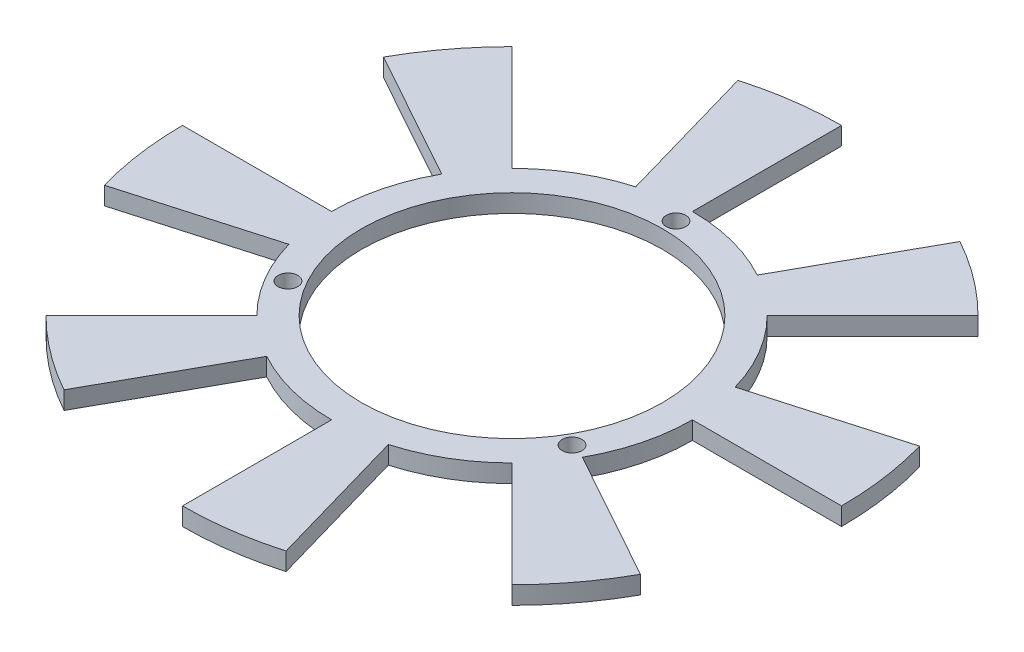
ISO-10303-21;
HEADER;
FILE_DESCRIPTION(('STEP AP214'),'2;1');
FILE_NAME('part.step','',(''),(''),'','','');
FILE_SCHEMA(('AUTOMOTIVE_DESIGN { 1 0 10303 214 1 1 1 1 }'));
ENDSEC;
DATA;
#1=APPLICATION_CONTEXT('core data for automotive mechanical design processes');
#2=APPLICATION_PROTOCOL_DEFINITION('international standard','automotive_design',2000,#1);
#3=PRODUCT_CONTEXT('',#1,'mechanical');
#4=PRODUCT('Part','Part','',(#3));
#5=PRODUCT_RELATED_PRODUCT_CATEGORY('part','',(#4));
#6=PRODUCT_DEFINITION_FORMATION('','',#4);
#7=PRODUCT_DEFINITION_CONTEXT('part definition',#1,'design');
#8=PRODUCT_DEFINITION('design','',#6,#7);
#9=PRODUCT_DEFINITION_SHAPE('','',#8);
#10=(LENGTH_UNIT() NAMED_UNIT(*) SI_UNIT(.MILLI.,.METRE.));
#11=(NAMED_UNIT(*) PLANE_ANGLE_UNIT() SI_UNIT($,.RADIAN.));
#12=(NAMED_UNIT(*) SI_UNIT($,.STERADIAN.) SOLID_ANGLE_UNIT());
#13=UNCERTAINTY_MEASURE_WITH_UNIT(LENGTH_MEASURE(1.E-05),#10,'distance_accuracy_value','');
#14=(GEOMETRIC_REPRESENTATION_CONTEXT(3) GLOBAL_UNCERTAINTY_ASSIGNED_CONTEXT((#13)) GLOBAL_UNIT_ASSIGNED_CONTEXT((#10,
#11,#12)) REPRESENTATION_CONTEXT('',''));
#15=CARTESIAN_POINT('',(0.,0.,0.));
#16=DIRECTION('',(0.,0.,1.));
#17=DIRECTION('',(1.,0.,0.));
#18=AXIS2_PLACEMENT_3D('',#15,#16,#17);
#19=CARTESIAN_POINT('',(0.,-3.,0.));
#20=DIRECTION('',(0.,1.,0.));
#21=DIRECTION('',(0.,0.,1.));
#22=AXIS2_PLACEMENT_3D('',#19,#20,#21);
#23=CYLINDRICAL_SURFACE('',#22,30.25);
#24=DIRECTION('',(0.,-1.,0.));
#25=VECTOR('',#24,1.);
#26=CARTESIAN_POINT('',(-14.6654910124514,0.,26.4572461409669));
#27=LINE('',#26,#25);
#28=CARTESIAN_POINT('',(-14.6654910124514,0.,26.4572461409669));
#29=VERTEX_POINT('',#28);
#30=CARTESIAN_POINT('',(-14.6654910124514,-3.,26.4572461409669));
#31=VERTEX_POINT('',#30);
#32=EDGE_CURVE('E286',#29,#31,#27,.T.);
#33=ORIENTED_EDGE('',*,*,#32,.T.);
#34=CARTESIAN_POINT('',(0.,-3.,0.));
#35=DIRECTION('',(0.,1.,0.));
#36=DIRECTION('',(1.,0.,0.));
#37=AXIS2_PLACEMENT_3D('',#34,#35,#36);
#38=CIRCLE('',#37,30.25);
#39=CARTESIAN_POINT('',(0.,-3.,30.25));
#40=VERTEX_POINT('',#39);
#41=EDGE_CURVE('E51',#31,#40,#38,.T.);
#42=ORIENTED_EDGE('',*,*,#41,.T.);
#43=DIRECTION('',(0.,-1.,0.));
#44=VECTOR('',#43,1.);
#45=CARTESIAN_POINT('',(0.,0.,30.25));
#46=LINE('',#45,#44);
#47=CARTESIAN_POINT('',(0.,0.,30.25));
#48=VERTEX_POINT('',#47);
#49=EDGE_CURVE('E442',#48,#40,#46,.T.);
#50=ORIENTED_EDGE('',*,*,#49,.F.);
#51=CARTESIAN_POINT('',(0.,0.,0.));
#52=DIRECTION('',(0.,1.,0.));
#53=DIRECTION('',(1.,0.,0.));
#54=AXIS2_PLACEMENT_3D('',#51,#52,#53);
#55=CIRCLE('',#54,30.25);
#56=EDGE_CURVE('E541',#29,#48,#55,.T.);
#57=ORIENTED_EDGE('',*,*,#56,.F.);
#58=EDGE_LOOP('',(#33,#42,#50,#57));
#59=FACE_BOUND('',#58,.T.);
#60=ADVANCED_FACE('F41',(#59),#23,.T.);
#61=DIRECTION('',(0.,-1.,0.));
#62=VECTOR('',#61,1.);
#63=CARTESIAN_POINT('',(-21.389980130893,0.,21.3899801308931));
#64=LINE('',#63,#62);
#65=CARTESIAN_POINT('',(-21.389980130893,0.,21.3899801308931));
#66=VERTEX_POINT('',#65);
#67=CARTESIAN_POINT('',(-21.389980130893,-3.,21.3899801308931));
#68=VERTEX_POINT('',#67);
#69=EDGE_CURVE('E265',#66,#68,#64,.T.);
#70=ORIENTED_EDGE('',*,*,#69,.F.);
#71=CARTESIAN_POINT('',(-29.0781663021341,0.,8.33803001346455));
#72=VERTEX_POINT('',#71);
#73=EDGE_CURVE('E271',#72,#66,#55,.T.);
#74=ORIENTED_EDGE('',*,*,#73,.F.);
#75=DIRECTION('',(0.,-1.,0.));
#76=VECTOR('',#75,1.);
#77=CARTESIAN_POINT('',(-29.0781663021341,0.,8.33803001346455));
#78=LINE('',#77,#76);
#79=CARTESIAN_POINT('',(-29.0781663021341,-3.,8.33803001346455));
#80=VERTEX_POINT('',#79);
#81=EDGE_CURVE('E308',#72,#80,#78,.T.);
#82=ORIENTED_EDGE('',*,*,#81,.T.);
#83=EDGE_CURVE('E612',#80,#68,#38,.T.);
#84=ORIENTED_EDGE('',*,*,#83,.T.);
#85=EDGE_LOOP('',(#70,#74,#82,#84));
#86=FACE_BOUND('',#85,.T.);
#87=ADVANCED_FACE('F516',(#86),#23,.T.);
#88=DIRECTION('',(0.,-1.,0.));
#89=VECTOR('',#88,1.);
#90=CARTESIAN_POINT('',(-30.25,0.,0.));
#91=LINE('',#90,#89);
#92=CARTESIAN_POINT('',(-30.25,0.,0.));
#93=VERTEX_POINT('',#92);
#94=CARTESIAN_POINT('',(-30.25,-3.,0.));
#95=VERTEX_POINT('',#94);
#96=EDGE_CURVE('E311',#93,#95,#91,.T.);
#97=ORIENTED_EDGE('',*,*,#96,.F.);
#98=CARTESIAN_POINT('',(-26.4572461409669,0.,-14.6654910124514));
#99=VERTEX_POINT('',#98);
#100=EDGE_CURVE('E589',#99,#93,#55,.T.);
#101=ORIENTED_EDGE('',*,*,#100,.F.);
#102=DIRECTION('',(0.,-1.,0.));
#103=VECTOR('',#102,1.);
#104=CARTESIAN_POINT('',(-26.4572461409669,0.,-14.6654910124514));
#105=LINE('',#104,#103);
#106=CARTESIAN_POINT('',(-26.4572461409669,-3.,-14.6654910124514));
#107=VERTEX_POINT('',#106);
#108=EDGE_CURVE('E334',#99,#107,#105,.T.);
#109=ORIENTED_EDGE('',*,*,#108,.T.);
#110=EDGE_CURVE('E601',#107,#95,#38,.T.);
#111=ORIENTED_EDGE('',*,*,#110,.T.);
#112=EDGE_LOOP('',(#97,#101,#109,#111));
#113=FACE_BOUND('',#112,.T.);
#114=ADVANCED_FACE('F521',(#113),#23,.T.);
#115=DIRECTION('',(0.,-1.,0.));
#116=VECTOR('',#115,1.);
#117=CARTESIAN_POINT('',(-21.3899801308931,0.,-21.389980130893));
#118=LINE('',#117,#116);
#119=CARTESIAN_POINT('',(-21.3899801308931,0.,-21.389980130893));
#120=VERTEX_POINT('',#119);
#121=CARTESIAN_POINT('',(-21.3899801308931,-3.,-21.389980130893));
#122=VERTEX_POINT('',#121);
#123=EDGE_CURVE('E337',#120,#122,#118,.T.);
#124=ORIENTED_EDGE('',*,*,#123,.F.);
#125=CARTESIAN_POINT('',(-8.33803001346424,0.,-29.0781663021341));
#126=VERTEX_POINT('',#125);
#127=EDGE_CURVE('E587',#126,#120,#55,.T.);
#128=ORIENTED_EDGE('',*,*,#127,.F.);
#129=DIRECTION('',(0.,-1.,0.));
#130=VECTOR('',#129,1.);
#131=CARTESIAN_POINT('',(-8.33803001346424,0.,-29.0781663021341));
#132=LINE('',#131,#130);
#133=CARTESIAN_POINT('',(-8.33803001346424,-3.,-29.0781663021341));
#134=VERTEX_POINT('',#133);
#135=EDGE_CURVE('E360',#126,#134,#132,.T.);
#136=ORIENTED_EDGE('',*,*,#135,.T.);
#137=EDGE_CURVE('E865',#134,#122,#38,.T.);
#138=ORIENTED_EDGE('',*,*,#137,.T.);
#139=EDGE_LOOP('',(#124,#128,#136,#138));
#140=FACE_BOUND('',#139,.T.);
#141=ADVANCED_FACE('F864',(#140),#23,.T.);
#142=DIRECTION('',(0.,-1.,0.));
#143=VECTOR('',#142,1.);
#144=CARTESIAN_POINT('',(0.,0.,-30.25));
#145=LINE('',#144,#143);
#146=CARTESIAN_POINT('',(0.,0.,-30.25));
#147=VERTEX_POINT('',#146);
#148=CARTESIAN_POINT('',(0.,-3.,-30.25));
#149=VERTEX_POINT('',#148);
#150=EDGE_CURVE('E363',#147,#149,#145,.T.);
#151=ORIENTED_EDGE('',*,*,#150,.F.);
#152=CARTESIAN_POINT('',(14.6654910124512,0.,-26.457246140967));
#153=VERTEX_POINT('',#152);
#154=EDGE_CURVE('E543',#153,#147,#55,.T.);
#155=ORIENTED_EDGE('',*,*,#154,.F.);
#156=DIRECTION('',(0.,-1.,0.));
#157=VECTOR('',#156,1.);
#158=CARTESIAN_POINT('',(14.6654910124512,0.,-26.457246140967));
#159=LINE('',#158,#157);
#160=CARTESIAN_POINT('',(14.6654910124512,-3.,-26.457246140967));
#161=VERTEX_POINT('',#160);
#162=EDGE_CURVE('E386',#153,#161,#159,.T.);
#163=ORIENTED_EDGE('',*,*,#162,.T.);
#164=EDGE_CURVE('E867',#161,#149,#38,.T.);
#165=ORIENTED_EDGE('',*,*,#164,.T.);
#166=EDGE_LOOP('',(#151,#155,#163,#165));
#167=FACE_BOUND('',#166,.T.);
#168=ADVANCED_FACE('F872',(#167),#23,.T.);
#169=DIRECTION('',(0.,-1.,0.));
#170=VECTOR('',#169,1.);
#171=CARTESIAN_POINT('',(21.3899801308931,0.,-21.3899801308931));
#172=LINE('',#171,#170);
#173=CARTESIAN_POINT('',(21.3899801308931,0.,-21.3899801308931));
#174=VERTEX_POINT('',#173);
#175=CARTESIAN_POINT('',(21.3899801308931,-3.,-21.3899801308931));
#176=VERTEX_POINT('',#175);
#177=EDGE_CURVE('E389',#174,#176,#172,.T.);
#178=ORIENTED_EDGE('',*,*,#177,.F.);
#179=CARTESIAN_POINT('',(29.078166302134,0.,-8.33803001346475));
#180=VERTEX_POINT('',#179);
#181=EDGE_CURVE('E540',#180,#174,#55,.T.);
#182=ORIENTED_EDGE('',*,*,#181,.F.);
#183=DIRECTION('',(0.,-1.,0.));
#184=VECTOR('',#183,1.);
#185=CARTESIAN_POINT('',(29.078166302134,0.,-8.33803001346475));
#186=LINE('',#185,#184);
#187=CARTESIAN_POINT('',(29.078166302134,-3.,-8.33803001346475));
#188=VERTEX_POINT('',#187);
#189=EDGE_CURVE('E412',#180,#188,#186,.T.);
#190=ORIENTED_EDGE('',*,*,#189,.T.);
#191=EDGE_CURVE('E50',#188,#176,#38,.T.);
#192=ORIENTED_EDGE('',*,*,#191,.T.);
#193=EDGE_LOOP('',(#178,#182,#190,#192));
#194=FACE_BOUND('',#193,.T.);
#195=ADVANCED_FACE('F529',(#194),#23,.T.);
#196=DIRECTION('',(0.,-1.,0.));
#197=VECTOR('',#196,1.);
#198=CARTESIAN_POINT('',(8.33803001346424,0.,29.0781663021341));
#199=LINE('',#198,#197);
#200=CARTESIAN_POINT('',(8.33803001346424,0.,29.0781663021341));
#201=VERTEX_POINT('',#200);
#202=CARTESIAN_POINT('',(8.33803001346424,-3.,29.0781663021341));
#203=VERTEX_POINT('',#202);
#204=EDGE_CURVE('E439',#201,#203,#199,.T.);
#205=ORIENTED_EDGE('',*,*,#204,.T.);
#206=CARTESIAN_POINT('',(21.3899801308931,-3.,21.3899801308931));
#207=VERTEX_POINT('',#206);
#208=EDGE_CURVE('E52',#203,#207,#38,.T.);
#209=ORIENTED_EDGE('',*,*,#208,.T.);
#210=DIRECTION('',(0.,-1.,0.));
#211=VECTOR('',#210,1.);
#212=CARTESIAN_POINT('',(21.3899801308931,0.,21.3899801308931));
#213=LINE('',#212,#211);
#214=CARTESIAN_POINT('',(21.3899801308931,0.,21.3899801308931));
#215=VERTEX_POINT('',#214);
#216=EDGE_CURVE('E470',#215,#207,#213,.T.);
#217=ORIENTED_EDGE('',*,*,#216,.F.);
#218=EDGE_CURVE('E495',#201,#215,#55,.T.);
#219=ORIENTED_EDGE('',*,*,#218,.F.);
#220=EDGE_LOOP('',(#205,#209,#217,#219));
#221=FACE_BOUND('',#220,.T.);
#222=ADVANCED_FACE('F524',(#221),#23,.T.);
#223=DIRECTION('',(0.,-1.,0.));
#224=VECTOR('',#223,1.);
#225=CARTESIAN_POINT('',(30.25,0.,0.));
#226=LINE('',#225,#224);
#227=CARTESIAN_POINT('',(30.25,0.,0.));
#228=VERTEX_POINT('',#227);
#229=CARTESIAN_POINT('',(30.25,-3.,0.));
#230=VERTEX_POINT('',#229);
#231=EDGE_CURVE('E415',#228,#230,#226,.T.);
#232=ORIENTED_EDGE('',*,*,#231,.F.);
#233=CARTESIAN_POINT('',(26.457246140967,0.,14.6654910124513));
#234=VERTEX_POINT('',#233);
#235=EDGE_CURVE('E45',#234,#228,#55,.T.);
#236=ORIENTED_EDGE('',*,*,#235,.F.);
#237=DIRECTION('',(0.,-1.,0.));
#238=VECTOR('',#237,1.);
#239=CARTESIAN_POINT('',(26.457246140967,0.,14.6654910124513));
#240=LINE('',#239,#238);
#241=CARTESIAN_POINT('',(26.457246140967,-3.,14.6654910124513));
#242=VERTEX_POINT('',#241);
#243=EDGE_CURVE('E467',#234,#242,#240,.T.);
#244=ORIENTED_EDGE('',*,*,#243,.T.);
#245=EDGE_CURVE('E12',#242,#230,#38,.T.);
#246=ORIENTED_EDGE('',*,*,#245,.T.);
#247=EDGE_LOOP('',(#232,#236,#244,#246));
#248=FACE_BOUND('',#247,.T.);
#249=ADVANCED_FACE('F43',(#248),#23,.T.);
#250=CARTESIAN_POINT('',(0.,-3.,0.));
#251=DIRECTION('',(0.,1.,0.));
#252=DIRECTION('',(0.,0.,1.));
#253=AXIS2_PLACEMENT_3D('',#250,#251,#252);
#254=PLANE('',#253);
#255=CARTESIAN_POINT('',(0.,-3.,-27.5));
#256=DIRECTION('',(0.,1.,0.));
#257=DIRECTION('',(0.,0.,1.));
#258=AXIS2_PLACEMENT_3D('',#255,#256,#257);
#259=CIRCLE('',#258,1.65);
#260=CARTESIAN_POINT('',(0.,-3.,-25.85));
#261=VERTEX_POINT('',#260);
#262=EDGE_CURVE('E488',#261,#261,#259,.T.);
#263=ORIENTED_EDGE('',*,*,#262,.T.);
#264=EDGE_LOOP('',(#263));
#265=FACE_BOUND('',#264,.T.);
#266=CARTESIAN_POINT('',(23.815698604072,-3.,13.7500000000001));
#267=DIRECTION('',(0.,1.,0.));
#268=DIRECTION('',(0.,0.,1.));
#269=AXIS2_PLACEMENT_3D('',#266,#267,#268);
#270=CIRCLE('',#269,1.65);
#271=CARTESIAN_POINT('',(23.815698604072,-3.,15.4000000000001));
#272=VERTEX_POINT('',#271);
#273=EDGE_CURVE('E485',#272,#272,#270,.T.);
#274=ORIENTED_EDGE('',*,*,#273,.T.);
#275=EDGE_LOOP('',(#274));
#276=FACE_BOUND('',#275,.T.);
#277=CARTESIAN_POINT('',(-23.815698604072,-3.,13.7500000000001));
#278=DIRECTION('',(0.,1.,0.));
#279=DIRECTION('',(0.,0.,1.));
#280=AXIS2_PLACEMENT_3D('',#277,#278,#279);
#281=CIRCLE('',#280,1.65);
#282=CARTESIAN_POINT('',(-23.815698604072,-3.,15.4000000000001));
#283=VERTEX_POINT('',#282);
#284=EDGE_CURVE('E477',#283,#283,#281,.T.);
#285=ORIENTED_EDGE('',*,*,#284,.T.);
#286=EDGE_LOOP('',(#285));
#287=FACE_BOUND('',#286,.T.);
#288=CARTESIAN_POINT('',(0.,-3.,0.));
#289=DIRECTION('',(0.,1.,0.));
#290=DIRECTION('',(0.,0.,1.));
#291=AXIS2_PLACEMENT_3D('',#288,#289,#290);
#292=CIRCLE('',#291,25.25);
#293=CARTESIAN_POINT('',(0.,-3.,25.25));
#294=VERTEX_POINT('',#293);
#295=EDGE_CURVE('E492',#294,#294,#292,.T.);
#296=ORIENTED_EDGE('',*,*,#295,.T.);
#297=EDGE_LOOP('',(#296));
#298=FACE_BOUND('',#297,.T.);
#299=ORIENTED_EDGE('',*,*,#245,.F.);
#300=DIRECTION('',(0.874619707139387,0.,0.484809620246354));
#301=VECTOR('',#300,1.);
#302=CARTESIAN_POINT('',(26.457246140967,-3.,14.6654910124513));
#303=LINE('',#302,#301);
#304=CARTESIAN_POINT('',(48.3227388194516,-3.,26.7857315186101));
#305=VERTEX_POINT('',#304);
#306=EDGE_CURVE('E450',#242,#305,#303,.T.);
#307=ORIENTED_EDGE('',*,*,#306,.T.);
#308=CARTESIAN_POINT('',(0.,-3.,0.));
#309=DIRECTION('',(0.,-1.,0.));
#310=DIRECTION('',(0.,0.,-1.));
#311=AXIS2_PLACEMENT_3D('',#308,#309,#310);
#312=CIRCLE('',#311,55.25);
#313=CARTESIAN_POINT('',(39.0676496605568,-3.,39.0676496605568));
#314=VERTEX_POINT('',#313);
#315=EDGE_CURVE('E438',#305,#314,#312,.T.);
#316=ORIENTED_EDGE('',*,*,#315,.T.);
#317=DIRECTION('',(-0.707106781186547,0.,-0.707106781186548));
#318=VECTOR('',#317,1.);
#319=CARTESIAN_POINT('',(39.0676496605568,-3.,39.0676496605568));
#320=LINE('',#319,#318);
#321=EDGE_CURVE('E459',#314,#207,#320,.T.);
#322=ORIENTED_EDGE('',*,*,#321,.T.);
#323=ORIENTED_EDGE('',*,*,#208,.F.);
#324=DIRECTION('',(0.275637355817,0.,0.961261695938319));
#325=VECTOR('',#324,1.);
#326=CARTESIAN_POINT('',(8.33803001346424,-3.,29.0781663021341));
#327=LINE('',#326,#325);
#328=CARTESIAN_POINT('',(15.2289639088892,-3.,53.1097087005921));
#329=VERTEX_POINT('',#328);
#330=EDGE_CURVE('E422',#203,#329,#327,.T.);
#331=ORIENTED_EDGE('',*,*,#330,.T.);
#332=CARTESIAN_POINT('',(0.,-3.,0.));
#333=DIRECTION('',(0.,-1.,0.));
#334=DIRECTION('',(0.,0.,-1.));
#335=AXIS2_PLACEMENT_3D('',#332,#333,#334);
#336=CIRCLE('',#335,55.25);
#337=CARTESIAN_POINT('',(0.,-3.,55.25));
#338=VERTEX_POINT('',#337);
#339=EDGE_CURVE('E411',#329,#338,#336,.T.);
#340=ORIENTED_EDGE('',*,*,#339,.T.);
#341=DIRECTION('',(0.,0.,-1.));
#342=VECTOR('',#341,1.);
#343=CARTESIAN_POINT('',(0.,-3.,55.25));
#344=LINE('',#343,#342);
#345=EDGE_CURVE('E431',#338,#40,#344,.T.);
#346=ORIENTED_EDGE('',*,*,#345,.T.);
#347=ORIENTED_EDGE('',*,*,#41,.F.);
#348=DIRECTION('',(-0.48480962024635,0.,0.874619707139389));
#349=VECTOR('',#348,1.);
#350=CARTESIAN_POINT('',(-14.6654910124514,-3.,26.4572461409669));
#351=LINE('',#350,#349);
#352=CARTESIAN_POINT('',(-26.7857315186101,-3.,48.3227388194516));
#353=VERTEX_POINT('',#352);
#354=EDGE_CURVE('E275',#31,#353,#351,.T.);
#355=ORIENTED_EDGE('',*,*,#354,.T.);
#356=CARTESIAN_POINT('',(0.,-3.,0.));
#357=DIRECTION('',(0.,-1.,0.));
#358=DIRECTION('',(0.,0.,-1.));
#359=AXIS2_PLACEMENT_3D('',#356,#357,#358);
#360=CIRCLE('',#359,55.25);
#361=CARTESIAN_POINT('',(-39.0676496605568,-3.,39.0676496605568));
#362=VERTEX_POINT('',#361);
#363=EDGE_CURVE('E281',#353,#362,#360,.T.);
#364=ORIENTED_EDGE('',*,*,#363,.T.);
#365=DIRECTION('',(0.707106781186549,0.,-0.707106781186546));
#366=VECTOR('',#365,1.);
#367=CARTESIAN_POINT('',(-39.0676496605568,-3.,39.0676496605568));
#368=LINE('',#367,#366);
#369=EDGE_CURVE('E260',#362,#68,#368,.T.);
#370=ORIENTED_EDGE('',*,*,#369,.T.);
#371=ORIENTED_EDGE('',*,*,#83,.F.);
#372=DIRECTION('',(-0.961261695938322,0.,0.275637355816987));
#373=VECTOR('',#372,1.);
#374=CARTESIAN_POINT('',(-29.0781663021341,-3.,8.33803001346455));
#375=LINE('',#374,#373);
#376=CARTESIAN_POINT('',(-53.1097087005921,-3.,15.2289639088892));
#377=VERTEX_POINT('',#376);
#378=EDGE_CURVE('E294',#80,#377,#375,.T.);
#379=ORIENTED_EDGE('',*,*,#378,.T.);
#380=CARTESIAN_POINT('',(0.,-3.,0.));
#381=DIRECTION('',(0.,-1.,0.));
#382=DIRECTION('',(0.,0.,-1.));
#383=AXIS2_PLACEMENT_3D('',#380,#381,#382);
#384=CIRCLE('',#383,55.25);
#385=CARTESIAN_POINT('',(-55.25,-3.,0.));
#386=VERTEX_POINT('',#385);
#387=EDGE_CURVE('E285',#377,#386,#384,.T.);
#388=ORIENTED_EDGE('',*,*,#387,.T.);
#389=DIRECTION('',(1.,0.,0.));
#390=VECTOR('',#389,1.);
#391=CARTESIAN_POINT('',(-55.25,-3.,0.));
#392=LINE('',#391,#390);
#393=EDGE_CURVE('E300',#386,#95,#392,.T.);
#394=ORIENTED_EDGE('',*,*,#393,.T.);
#395=ORIENTED_EDGE('',*,*,#110,.F.);
#396=DIRECTION('',(-0.874619707139391,0.,-0.484809620246346));
#397=VECTOR('',#396,1.);
#398=CARTESIAN_POINT('',(-26.4572461409669,-3.,-14.6654910124515));
#399=LINE('',#398,#397);
#400=CARTESIAN_POINT('',(-48.3227388194516,-3.,-26.7857315186101));
#401=VERTEX_POINT('',#400);
#402=EDGE_CURVE('E318',#107,#401,#399,.T.);
#403=ORIENTED_EDGE('',*,*,#402,.T.);
#404=CARTESIAN_POINT('',(0.,-3.,0.));
#405=DIRECTION('',(0.,-1.,0.));
#406=DIRECTION('',(0.,0.,-1.));
#407=AXIS2_PLACEMENT_3D('',#404,#405,#406);
#408=CIRCLE('',#407,55.25);
#409=CARTESIAN_POINT('',(-39.0676496605568,-3.,-39.0676496605568));
#410=VERTEX_POINT('',#409);
#411=EDGE_CURVE('E307',#401,#410,#408,.T.);
#412=ORIENTED_EDGE('',*,*,#411,.T.);
#413=DIRECTION('',(0.707106781186547,0.,0.707106781186548));
#414=VECTOR('',#413,1.);
#415=CARTESIAN_POINT('',(-39.0676496605568,-3.,-39.0676496605568));
#416=LINE('',#415,#414);
#417=EDGE_CURVE('E326',#410,#122,#416,.T.);
#418=ORIENTED_EDGE('',*,*,#417,.T.);
#419=ORIENTED_EDGE('',*,*,#137,.F.);
#420=DIRECTION('',(-0.275637355817,0.,-0.961261695938319));
#421=VECTOR('',#420,1.);
#422=CARTESIAN_POINT('',(-8.33803001346424,-3.,-29.0781663021341));
#423=LINE('',#422,#421);
#424=CARTESIAN_POINT('',(-15.2289639088892,-3.,-53.1097087005921));
#425=VERTEX_POINT('',#424);
#426=EDGE_CURVE('E344',#134,#425,#423,.T.);
#427=ORIENTED_EDGE('',*,*,#426,.T.);
#428=CARTESIAN_POINT('',(0.,-3.,0.));
#429=DIRECTION('',(0.,-1.,0.));
#430=DIRECTION('',(0.,0.,-1.));
#431=AXIS2_PLACEMENT_3D('',#428,#429,#430);
#432=CIRCLE('',#431,55.25);
#433=CARTESIAN_POINT('',(0.,-3.,-55.25));
#434=VERTEX_POINT('',#433);
#435=EDGE_CURVE('E333',#425,#434,#432,.T.);
#436=ORIENTED_EDGE('',*,*,#435,.T.);
#437=DIRECTION('',(0.,0.,1.));
#438=VECTOR('',#437,1.);
#439=CARTESIAN_POINT('',(0.,-3.,-55.25));
#440=LINE('',#439,#438);
#441=EDGE_CURVE('E352',#434,#149,#440,.T.);
#442=ORIENTED_EDGE('',*,*,#441,.T.);
#443=ORIENTED_EDGE('',*,*,#164,.F.);
#444=DIRECTION('',(0.484809620246357,0.,-0.874619707139385));
#445=VECTOR('',#444,1.);
#446=CARTESIAN_POINT('',(14.6654910124512,-3.,-26.457246140967));
#447=LINE('',#446,#445);
#448=CARTESIAN_POINT('',(26.7857315186101,-3.,-48.3227388194516));
#449=VERTEX_POINT('',#448);
#450=EDGE_CURVE('E370',#161,#449,#447,.T.);
#451=ORIENTED_EDGE('',*,*,#450,.T.);
#452=CARTESIAN_POINT('',(0.,-3.,0.));
#453=DIRECTION('',(0.,-1.,0.));
#454=DIRECTION('',(0.,0.,-1.));
#455=AXIS2_PLACEMENT_3D('',#452,#453,#454);
#456=CIRCLE('',#455,55.25);
#457=CARTESIAN_POINT('',(39.0676496605568,-3.,-39.0676496605568));
#458=VERTEX_POINT('',#457);
#459=EDGE_CURVE('E359',#449,#458,#456,.T.);
#460=ORIENTED_EDGE('',*,*,#459,.T.);
#461=DIRECTION('',(-0.707106781186548,0.,0.707106781186547));
#462=VECTOR('',#461,1.);
#463=CARTESIAN_POINT('',(39.0676496605568,-3.,-39.0676496605568));
#464=LINE('',#463,#462);
#465=EDGE_CURVE('E378',#458,#176,#464,.T.);
#466=ORIENTED_EDGE('',*,*,#465,.T.);
#467=ORIENTED_EDGE('',*,*,#191,.F.);
#468=DIRECTION('',(0.961261695938325,0.,-0.27563735581698));
#469=VECTOR('',#468,1.);
#470=CARTESIAN_POINT('',(29.078166302134,-3.,-8.33803001346475));
#471=LINE('',#470,#469);
#472=CARTESIAN_POINT('',(53.1097087005921,-3.,-15.2289639088892));
#473=VERTEX_POINT('',#472);
#474=EDGE_CURVE('E396',#188,#473,#471,.T.);
#475=ORIENTED_EDGE('',*,*,#474,.T.);
#476=CARTESIAN_POINT('',(0.,-3.,0.));
#477=DIRECTION('',(0.,-1.,0.));
#478=DIRECTION('',(0.,0.,-1.));
#479=AXIS2_PLACEMENT_3D('',#476,#477,#478);
#480=CIRCLE('',#479,55.25);
#481=CARTESIAN_POINT('',(55.25,-3.,0.));
#482=VERTEX_POINT('',#481);
#483=EDGE_CURVE('E385',#473,#482,#480,.T.);
#484=ORIENTED_EDGE('',*,*,#483,.T.);
#485=DIRECTION('',(-1.,0.,0.));
#486=VECTOR('',#485,1.);
#487=CARTESIAN_POINT('',(55.25,-3.,0.));
#488=LINE('',#487,#486);
#489=EDGE_CURVE('E404',#482,#230,#488,.T.);
#490=ORIENTED_EDGE('',*,*,#489,.T.);
#491=EDGE_LOOP('',(#299,#307,#316,#322,#323,#331,#340,#346,#347,#355,#364,#370,#371,#379,#388,
#394,#395,#403,#412,#418,#419,#427,#436,#442,#443,#451,#460,#466,#467,#475,#484,#490));
#492=FACE_BOUND('',#491,.T.);
#493=ADVANCED_FACE('F502',(#265,#276,#287,#298,#492),#254,.F.);
#494=CARTESIAN_POINT('',(0.,0.,0.));
#495=DIRECTION('',(0.,1.,0.));
#496=DIRECTION('',(0.,0.,1.));
#497=AXIS2_PLACEMENT_3D('',#494,#495,#496);
#498=PLANE('',#497);
#499=CARTESIAN_POINT('',(0.,0.,-27.5));
#500=DIRECTION('',(0.,1.,0.));
#501=DIRECTION('',(0.,0.,1.));
#502=AXIS2_PLACEMENT_3D('',#499,#500,#501);
#503=CIRCLE('',#502,1.65);
#504=CARTESIAN_POINT('',(0.,0.,-25.85));
#505=VERTEX_POINT('',#504);
#506=EDGE_CURVE('E474',#505,#505,#503,.T.);
#507=ORIENTED_EDGE('',*,*,#506,.F.);
#508=EDGE_LOOP('',(#507));
#509=FACE_BOUND('',#508,.T.);
#510=CARTESIAN_POINT('',(23.815698604072,0.,13.7500000000001));
#511=DIRECTION('',(0.,1.,0.));
#512=DIRECTION('',(0.,0.,1.));
#513=AXIS2_PLACEMENT_3D('',#510,#511,#512);
#514=CIRCLE('',#513,1.65);
#515=CARTESIAN_POINT('',(23.815698604072,0.,15.4000000000001));
#516=VERTEX_POINT('',#515);
#517=EDGE_CURVE('E478',#516,#516,#514,.T.);
#518=ORIENTED_EDGE('',*,*,#517,.F.);
#519=EDGE_LOOP('',(#518));
#520=FACE_BOUND('',#519,.T.);
#521=CARTESIAN_POINT('',(-23.815698604072,0.,13.7500000000001));
#522=DIRECTION('',(0.,1.,0.));
#523=DIRECTION('',(0.,0.,1.));
#524=AXIS2_PLACEMENT_3D('',#521,#522,#523);
#525=CIRCLE('',#524,1.65);
#526=CARTESIAN_POINT('',(-23.815698604072,0.,15.4000000000001));
#527=VERTEX_POINT('',#526);
#528=EDGE_CURVE('E466',#527,#527,#525,.T.);
#529=ORIENTED_EDGE('',*,*,#528,.F.);
#530=EDGE_LOOP('',(#529));
#531=FACE_BOUND('',#530,.T.);
#532=CARTESIAN_POINT('',(0.,0.,0.));
#533=DIRECTION('',(0.,1.,0.));
#534=DIRECTION('',(0.,0.,1.));
#535=AXIS2_PLACEMENT_3D('',#532,#533,#534);
#536=CIRCLE('',#535,25.25);
#537=CARTESIAN_POINT('',(0.,0.,25.25));
#538=VERTEX_POINT('',#537);
#539=EDGE_CURVE('E491',#538,#538,#536,.T.);
#540=ORIENTED_EDGE('',*,*,#539,.F.);
#541=EDGE_LOOP('',(#540));
#542=FACE_BOUND('',#541,.T.);
#543=ORIENTED_EDGE('',*,*,#235,.T.);
#544=DIRECTION('',(-1.,0.,0.));
#545=VECTOR('',#544,1.);
#546=CARTESIAN_POINT('',(55.25,0.,0.));
#547=LINE('',#546,#545);
#548=CARTESIAN_POINT('',(55.25,0.,0.));
#549=VERTEX_POINT('',#548);
#550=EDGE_CURVE('E395',#549,#228,#547,.T.);
#551=ORIENTED_EDGE('',*,*,#550,.F.);
#552=CARTESIAN_POINT('',(0.,0.,0.));
#553=DIRECTION('',(0.,-1.,0.));
#554=DIRECTION('',(0.,0.,-1.));
#555=AXIS2_PLACEMENT_3D('',#552,#553,#554);
#556=CIRCLE('',#555,55.25);
#557=CARTESIAN_POINT('',(53.1097087005921,0.,-15.2289639088892));
#558=VERTEX_POINT('',#557);
#559=EDGE_CURVE('E392',#558,#549,#556,.T.);
#560=ORIENTED_EDGE('',*,*,#559,.F.);
#561=DIRECTION('',(0.961261695938325,0.,-0.27563735581698));
#562=VECTOR('',#561,1.);
#563=CARTESIAN_POINT('',(29.078166302134,0.,-8.33803001346475));
#564=LINE('',#563,#562);
#565=EDGE_CURVE('E398',#180,#558,#564,.T.);
#566=ORIENTED_EDGE('',*,*,#565,.F.);
#567=ORIENTED_EDGE('',*,*,#181,.T.);
#568=DIRECTION('',(-0.707106781186548,0.,0.707106781186547));
#569=VECTOR('',#568,1.);
#570=CARTESIAN_POINT('',(39.0676496605568,0.,-39.0676496605568));
#571=LINE('',#570,#569);
#572=CARTESIAN_POINT('',(39.0676496605568,0.,-39.0676496605568));
#573=VERTEX_POINT('',#572);
#574=EDGE_CURVE('E369',#573,#174,#571,.T.);
#575=ORIENTED_EDGE('',*,*,#574,.F.);
#576=CARTESIAN_POINT('',(0.,0.,0.));
#577=DIRECTION('',(0.,-1.,0.));
#578=DIRECTION('',(0.,0.,-1.));
#579=AXIS2_PLACEMENT_3D('',#576,#577,#578);
#580=CIRCLE('',#579,55.25);
#581=CARTESIAN_POINT('',(26.7857315186101,0.,-48.3227388194516));
#582=VERTEX_POINT('',#581);
#583=EDGE_CURVE('E366',#582,#573,#580,.T.);
#584=ORIENTED_EDGE('',*,*,#583,.F.);
#585=DIRECTION('',(0.484809620246357,0.,-0.874619707139385));
#586=VECTOR('',#585,1.);
#587=CARTESIAN_POINT('',(14.6654910124512,0.,-26.457246140967));
#588=LINE('',#587,#586);
#589=EDGE_CURVE('E372',#153,#582,#588,.T.);
#590=ORIENTED_EDGE('',*,*,#589,.F.);
#591=ORIENTED_EDGE('',*,*,#154,.T.);
#592=DIRECTION('',(0.,0.,1.));
#593=VECTOR('',#592,1.);
#594=CARTESIAN_POINT('',(0.,0.,-55.25));
#595=LINE('',#594,#593);
#596=CARTESIAN_POINT('',(0.,0.,-55.25));
#597=VERTEX_POINT('',#596);
#598=EDGE_CURVE('E343',#597,#147,#595,.T.);
#599=ORIENTED_EDGE('',*,*,#598,.F.);
#600=CARTESIAN_POINT('',(0.,0.,0.));
#601=DIRECTION('',(0.,-1.,0.));
#602=DIRECTION('',(0.,0.,-1.));
#603=AXIS2_PLACEMENT_3D('',#600,#601,#602);
#604=CIRCLE('',#603,55.25);
#605=CARTESIAN_POINT('',(-15.2289639088892,0.,-53.1097087005921));
#606=VERTEX_POINT('',#605);
#607=EDGE_CURVE('E340',#606,#597,#604,.T.);
#608=ORIENTED_EDGE('',*,*,#607,.F.);
#609=DIRECTION('',(-0.275637355817,0.,-0.961261695938319));
#610=VECTOR('',#609,1.);
#611=CARTESIAN_POINT('',(-8.33803001346424,0.,-29.0781663021341));
#612=LINE('',#611,#610);
#613=EDGE_CURVE('E346',#126,#606,#612,.T.);
#614=ORIENTED_EDGE('',*,*,#613,.F.);
#615=ORIENTED_EDGE('',*,*,#127,.T.);
#616=DIRECTION('',(0.707106781186547,0.,0.707106781186548));
#617=VECTOR('',#616,1.);
#618=CARTESIAN_POINT('',(-39.0676496605568,0.,-39.0676496605568));
#619=LINE('',#618,#617);
#620=CARTESIAN_POINT('',(-39.0676496605568,0.,-39.0676496605568));
#621=VERTEX_POINT('',#620);
#622=EDGE_CURVE('E317',#621,#120,#619,.T.);
#623=ORIENTED_EDGE('',*,*,#622,.F.);
#624=CARTESIAN_POINT('',(0.,0.,0.));
#625=DIRECTION('',(0.,-1.,0.));
#626=DIRECTION('',(0.,0.,-1.));
#627=AXIS2_PLACEMENT_3D('',#624,#625,#626);
#628=CIRCLE('',#627,55.25);
#629=CARTESIAN_POINT('',(-48.3227388194516,0.,-26.7857315186101));
#630=VERTEX_POINT('',#629);
#631=EDGE_CURVE('E314',#630,#621,#628,.T.);
#632=ORIENTED_EDGE('',*,*,#631,.F.);
#633=DIRECTION('',(-0.874619707139391,0.,-0.484809620246346));
#634=VECTOR('',#633,1.);
#635=CARTESIAN_POINT('',(-26.4572461409669,0.,-14.6654910124515));
#636=LINE('',#635,#634);
#637=EDGE_CURVE('E320',#99,#630,#636,.T.);
#638=ORIENTED_EDGE('',*,*,#637,.F.);
#639=ORIENTED_EDGE('',*,*,#100,.T.);
#640=DIRECTION('',(1.,0.,0.));
#641=VECTOR('',#640,1.);
#642=CARTESIAN_POINT('',(-55.25,0.,0.));
#643=LINE('',#642,#641);
#644=CARTESIAN_POINT('',(-55.25,0.,0.));
#645=VERTEX_POINT('',#644);
#646=EDGE_CURVE('E293',#645,#93,#643,.T.);
#647=ORIENTED_EDGE('',*,*,#646,.F.);
#648=CARTESIAN_POINT('',(0.,0.,0.));
#649=DIRECTION('',(0.,-1.,0.));
#650=DIRECTION('',(0.,0.,-1.));
#651=AXIS2_PLACEMENT_3D('',#648,#649,#650);
#652=CIRCLE('',#651,55.25);
#653=CARTESIAN_POINT('',(-53.1097087005921,0.,15.2289639088892));
#654=VERTEX_POINT('',#653);
#655=EDGE_CURVE('E290',#654,#645,#652,.T.);
#656=ORIENTED_EDGE('',*,*,#655,.F.);
#657=DIRECTION('',(-0.961261695938322,0.,0.275637355816987));
#658=VECTOR('',#657,1.);
#659=CARTESIAN_POINT('',(-29.0781663021341,0.,8.33803001346455));
#660=LINE('',#659,#658);
#661=EDGE_CURVE('E66',#72,#654,#660,.T.);
#662=ORIENTED_EDGE('',*,*,#661,.F.);
#663=ORIENTED_EDGE('',*,*,#73,.T.);
#664=DIRECTION('',(0.707106781186549,0.,-0.707106781186546));
#665=VECTOR('',#664,1.);
#666=CARTESIAN_POINT('',(-39.0676496605568,0.,39.0676496605568));
#667=LINE('',#666,#665);
#668=CARTESIAN_POINT('',(-39.0676496605568,0.,39.0676496605568));
#669=VERTEX_POINT('',#668);
#670=EDGE_CURVE('E257',#669,#66,#667,.T.);
#671=ORIENTED_EDGE('',*,*,#670,.F.);
#672=CARTESIAN_POINT('',(0.,0.,0.));
#673=DIRECTION('',(0.,-1.,0.));
#674=DIRECTION('',(0.,0.,-1.));
#675=AXIS2_PLACEMENT_3D('',#672,#673,#674);
#676=CIRCLE('',#675,55.25);
#677=CARTESIAN_POINT('',(-26.7857315186101,0.,48.3227388194516));
#678=VERTEX_POINT('',#677);
#679=EDGE_CURVE('E269',#678,#669,#676,.T.);
#680=ORIENTED_EDGE('',*,*,#679,.F.);
#681=DIRECTION('',(-0.48480962024635,0.,0.874619707139389));
#682=VECTOR('',#681,1.);
#683=CARTESIAN_POINT('',(-14.6654910124514,0.,26.4572461409669));
#684=LINE('',#683,#682);
#685=EDGE_CURVE('E59',#29,#678,#684,.T.);
#686=ORIENTED_EDGE('',*,*,#685,.F.);
#687=ORIENTED_EDGE('',*,*,#56,.T.);
#688=DIRECTION('',(0.,0.,-1.));
#689=VECTOR('',#688,1.);
#690=CARTESIAN_POINT('',(0.,0.,55.25));
#691=LINE('',#690,#689);
#692=CARTESIAN_POINT('',(0.,0.,55.25));
#693=VERTEX_POINT('',#692);
#694=EDGE_CURVE('E421',#693,#48,#691,.T.);
#695=ORIENTED_EDGE('',*,*,#694,.F.);
#696=CARTESIAN_POINT('',(0.,0.,0.));
#697=DIRECTION('',(0.,-1.,0.));
#698=DIRECTION('',(0.,0.,-1.));
#699=AXIS2_PLACEMENT_3D('',#696,#697,#698);
#700=CIRCLE('',#699,55.25);
#701=CARTESIAN_POINT('',(15.2289639088892,0.,53.1097087005921));
#702=VERTEX_POINT('',#701);
#703=EDGE_CURVE('E418',#702,#693,#700,.T.);
#704=ORIENTED_EDGE('',*,*,#703,.F.);
#705=DIRECTION('',(0.275637355817,0.,0.961261695938319));
#706=VECTOR('',#705,1.);
#707=CARTESIAN_POINT('',(8.33803001346424,0.,29.0781663021341));
#708=LINE('',#707,#706);
#709=EDGE_CURVE('E425',#201,#702,#708,.T.);
#710=ORIENTED_EDGE('',*,*,#709,.F.);
#711=ORIENTED_EDGE('',*,*,#218,.T.);
#712=DIRECTION('',(-0.707106781186547,0.,-0.707106781186548));
#713=VECTOR('',#712,1.);
#714=CARTESIAN_POINT('',(39.0676496605568,0.,39.0676496605568));
#715=LINE('',#714,#713);
#716=CARTESIAN_POINT('',(39.0676496605568,0.,39.0676496605568));
#717=VERTEX_POINT('',#716);
#718=EDGE_CURVE('E449',#717,#215,#715,.T.);
#719=ORIENTED_EDGE('',*,*,#718,.F.);
#720=CARTESIAN_POINT('',(0.,0.,0.));
#721=DIRECTION('',(0.,-1.,0.));
#722=DIRECTION('',(0.,0.,-1.));
#723=AXIS2_PLACEMENT_3D('',#720,#721,#722);
#724=CIRCLE('',#723,55.25);
#725=CARTESIAN_POINT('',(48.3227388194516,0.,26.7857315186101));
#726=VERTEX_POINT('',#725);
#727=EDGE_CURVE('E446',#726,#717,#724,.T.);
#728=ORIENTED_EDGE('',*,*,#727,.F.);
#729=DIRECTION('',(0.874619707139387,0.,0.484809620246354));
#730=VECTOR('',#729,1.);
#731=CARTESIAN_POINT('',(26.457246140967,0.,14.6654910124513));
#732=LINE('',#731,#730);
#733=EDGE_CURVE('E453',#234,#726,#732,.T.);
#734=ORIENTED_EDGE('',*,*,#733,.F.);
#735=EDGE_LOOP('',(#543,#551,#560,#566,#567,#575,#584,#590,#591,#599,#608,#614,#615,#623,#632,
#638,#639,#647,#656,#662,#663,#671,#680,#686,#687,#695,#704,#710,#711,#719,#728,#734));
#736=FACE_BOUND('',#735,.T.);
#737=ADVANCED_FACE('F268',(#509,#520,#531,#542,#736),#498,.T.);
#738=CARTESIAN_POINT('',(0.,-3.,0.));
#739=DIRECTION('',(0.,1.,0.));
#740=DIRECTION('',(0.,0.,1.));
#741=AXIS2_PLACEMENT_3D('',#738,#739,#740);
#742=CYLINDRICAL_SURFACE('',#741,25.25);
#743=ORIENTED_EDGE('',*,*,#295,.F.);
#744=EDGE_LOOP('',(#743));
#745=FACE_BOUND('',#744,.T.);
#746=ORIENTED_EDGE('',*,*,#539,.T.);
#747=EDGE_LOOP('',(#746));
#748=FACE_BOUND('',#747,.T.);
#749=ADVANCED_FACE('F499',(#745,#748),#742,.F.);
#750=CARTESIAN_POINT('',(-23.815698604072,-10.,13.7500000000001));
#751=DIRECTION('',(0.,1.,0.));
#752=DIRECTION('',(0.,0.,1.));
#753=AXIS2_PLACEMENT_3D('',#750,#751,#752);
#754=CYLINDRICAL_SURFACE('',#753,1.65);
#755=ORIENTED_EDGE('',*,*,#528,.T.);
#756=EDGE_LOOP('',(#755));
#757=FACE_BOUND('',#756,.T.);
#758=ORIENTED_EDGE('',*,*,#284,.F.);
#759=EDGE_LOOP('',(#758));
#760=FACE_BOUND('',#759,.T.);
#761=ADVANCED_FACE('F508',(#757,#760),#754,.F.);
#762=CARTESIAN_POINT('',(23.815698604072,-10.,13.7500000000001));
#763=DIRECTION('',(0.,1.,0.));
#764=DIRECTION('',(0.,0.,1.));
#765=AXIS2_PLACEMENT_3D('',#762,#763,#764);
#766=CYLINDRICAL_SURFACE('',#765,1.65);
#767=ORIENTED_EDGE('',*,*,#517,.T.);
#768=EDGE_LOOP('',(#767));
#769=FACE_BOUND('',#768,.T.);
#770=ORIENTED_EDGE('',*,*,#273,.F.);
#771=EDGE_LOOP('',(#770));
#772=FACE_BOUND('',#771,.T.);
#773=ADVANCED_FACE('F647',(#769,#772),#766,.F.);
#774=CARTESIAN_POINT('',(0.,-10.,-27.5));
#775=DIRECTION('',(0.,1.,0.));
#776=DIRECTION('',(0.,0.,1.));
#777=AXIS2_PLACEMENT_3D('',#774,#775,#776);
#778=CYLINDRICAL_SURFACE('',#777,1.65);
#779=ORIENTED_EDGE('',*,*,#506,.T.);
#780=EDGE_LOOP('',(#779));
#781=FACE_BOUND('',#780,.T.);
#782=ORIENTED_EDGE('',*,*,#262,.F.);
#783=EDGE_LOOP('',(#782));
#784=FACE_BOUND('',#783,.T.);
#785=ADVANCED_FACE('F644',(#781,#784),#778,.F.);
#786=CARTESIAN_POINT('',(0.,0.,0.));
#787=DIRECTION('',(0.,-1.,0.));
#788=DIRECTION('',(0.,0.,-1.));
#789=AXIS2_PLACEMENT_3D('',#786,#787,#788);
#790=CYLINDRICAL_SURFACE('',#789,55.25);
#791=ORIENTED_EDGE('',*,*,#315,.F.);
#792=DIRECTION('',(0.,-1.,0.));
#793=VECTOR('',#792,1.);
#794=CARTESIAN_POINT('',(48.3227388194516,0.,26.7857315186101));
#795=LINE('',#794,#793);
#796=EDGE_CURVE('E464',#726,#305,#795,.T.);
#797=ORIENTED_EDGE('',*,*,#796,.F.);
#798=ORIENTED_EDGE('',*,*,#727,.T.);
#799=DIRECTION('',(0.,-1.,0.));
#800=VECTOR('',#799,1.);
#801=CARTESIAN_POINT('',(39.0676496605568,0.,39.0676496605568));
#802=LINE('',#801,#800);
#803=EDGE_CURVE('E456',#717,#314,#802,.T.);
#804=ORIENTED_EDGE('',*,*,#803,.T.);
#805=EDGE_LOOP('',(#791,#797,#798,#804));
#806=FACE_BOUND('',#805,.T.);
#807=ADVANCED_FACE('F556',(#806),#790,.T.);
#808=CARTESIAN_POINT('',(26.457246140967,0.,14.6654910124513));
#809=DIRECTION('',(0.484809620246354,0.,-0.874619707139387));
#810=DIRECTION('',(-0.874619707139387,0.,-0.484809620246354));
#811=AXIS2_PLACEMENT_3D('',#808,#809,#810);
#812=PLANE('',#811);
#813=ORIENTED_EDGE('',*,*,#306,.F.);
#814=ORIENTED_EDGE('',*,*,#243,.F.);
#815=ORIENTED_EDGE('',*,*,#733,.T.);
#816=ORIENTED_EDGE('',*,*,#796,.T.);
#817=EDGE_LOOP('',(#813,#814,#815,#816));
#818=FACE_BOUND('',#817,.T.);
#819=ADVANCED_FACE('F558',(#818),#812,.T.);
#820=CARTESIAN_POINT('',(39.0676496605568,0.,39.0676496605568));
#821=DIRECTION('',(-0.707106781186548,0.,0.707106781186547));
#822=DIRECTION('',(0.707106781186547,0.,0.707106781186548));
#823=AXIS2_PLACEMENT_3D('',#820,#821,#822);
#824=PLANE('',#823);
#825=ORIENTED_EDGE('',*,*,#321,.F.);
#826=ORIENTED_EDGE('',*,*,#803,.F.);
#827=ORIENTED_EDGE('',*,*,#718,.T.);
#828=ORIENTED_EDGE('',*,*,#216,.T.);
#829=EDGE_LOOP('',(#825,#826,#827,#828));
#830=FACE_BOUND('',#829,.T.);
#831=ADVANCED_FACE('F551',(#830),#824,.T.);
#832=CARTESIAN_POINT('',(0.,0.,0.));
#833=DIRECTION('',(0.,-1.,0.));
#834=DIRECTION('',(0.,0.,-1.));
#835=AXIS2_PLACEMENT_3D('',#832,#833,#834);
#836=CYLINDRICAL_SURFACE('',#835,55.25);
#837=ORIENTED_EDGE('',*,*,#339,.F.);
#838=DIRECTION('',(0.,-1.,0.));
#839=VECTOR('',#838,1.);
#840=CARTESIAN_POINT('',(15.2289639088892,0.,53.1097087005921));
#841=LINE('',#840,#839);
#842=EDGE_CURVE('E436',#702,#329,#841,.T.);
#843=ORIENTED_EDGE('',*,*,#842,.F.);
#844=ORIENTED_EDGE('',*,*,#703,.T.);
#845=DIRECTION('',(0.,-1.,0.));
#846=VECTOR('',#845,1.);
#847=CARTESIAN_POINT('',(0.,0.,55.25));
#848=LINE('',#847,#846);
#849=EDGE_CURVE('E428',#693,#338,#848,.T.);
#850=ORIENTED_EDGE('',*,*,#849,.T.);
#851=EDGE_LOOP('',(#837,#843,#844,#850));
#852=FACE_BOUND('',#851,.T.);
#853=ADVANCED_FACE('F624',(#852),#836,.T.);
#854=CARTESIAN_POINT('',(8.33803001346424,0.,29.0781663021341));
#855=DIRECTION('',(0.961261695938319,0.,-0.275637355817));
#856=DIRECTION('',(-0.275637355817,0.,-0.961261695938319));
#857=AXIS2_PLACEMENT_3D('',#854,#855,#856);
#858=PLANE('',#857);
#859=ORIENTED_EDGE('',*,*,#330,.F.);
#860=ORIENTED_EDGE('',*,*,#204,.F.);
#861=ORIENTED_EDGE('',*,*,#709,.T.);
#862=ORIENTED_EDGE('',*,*,#842,.T.);
#863=EDGE_LOOP('',(#859,#860,#861,#862));
#864=FACE_BOUND('',#863,.T.);
#865=ADVANCED_FACE('F626',(#864),#858,.T.);
#866=CARTESIAN_POINT('',(0.,0.,55.25));
#867=DIRECTION('',(-1.,0.,0.));
#868=DIRECTION('',(0.,0.,1.));
#869=AXIS2_PLACEMENT_3D('',#866,#867,#868);
#870=PLANE('',#869);
#871=ORIENTED_EDGE('',*,*,#345,.F.);
#872=ORIENTED_EDGE('',*,*,#849,.F.);
#873=ORIENTED_EDGE('',*,*,#694,.T.);
#874=ORIENTED_EDGE('',*,*,#49,.T.);
#875=EDGE_LOOP('',(#871,#872,#873,#874));
#876=FACE_BOUND('',#875,.T.);
#877=ADVANCED_FACE('F621',(#876),#870,.T.);
#878=CARTESIAN_POINT('',(0.,0.,0.));
#879=DIRECTION('',(0.,-1.,0.));
#880=DIRECTION('',(0.,0.,-1.));
#881=AXIS2_PLACEMENT_3D('',#878,#879,#880);
#882=CYLINDRICAL_SURFACE('',#881,55.25);
#883=ORIENTED_EDGE('',*,*,#483,.F.);
#884=DIRECTION('',(0.,-1.,0.));
#885=VECTOR('',#884,1.);
#886=CARTESIAN_POINT('',(53.1097087005921,0.,-15.2289639088892));
#887=LINE('',#886,#885);
#888=EDGE_CURVE('E409',#558,#473,#887,.T.);
#889=ORIENTED_EDGE('',*,*,#888,.F.);
#890=ORIENTED_EDGE('',*,*,#559,.T.);
#891=DIRECTION('',(0.,-1.,0.));
#892=VECTOR('',#891,1.);
#893=CARTESIAN_POINT('',(55.25,0.,0.));
#894=LINE('',#893,#892);
#895=EDGE_CURVE('E401',#549,#482,#894,.T.);
#896=ORIENTED_EDGE('',*,*,#895,.T.);
#897=EDGE_LOOP('',(#883,#889,#890,#896));
#898=FACE_BOUND('',#897,.T.);
#899=ADVANCED_FACE('F562',(#898),#882,.T.);
#900=CARTESIAN_POINT('',(29.078166302134,0.,-8.33803001346475));
#901=DIRECTION('',(-0.27563735581698,0.,-0.961261695938324));
#902=DIRECTION('',(-0.961261695938325,0.,0.27563735581698));
#903=AXIS2_PLACEMENT_3D('',#900,#901,#902);
#904=PLANE('',#903);
#905=ORIENTED_EDGE('',*,*,#474,.F.);
#906=ORIENTED_EDGE('',*,*,#189,.F.);
#907=ORIENTED_EDGE('',*,*,#565,.T.);
#908=ORIENTED_EDGE('',*,*,#888,.T.);
#909=EDGE_LOOP('',(#905,#906,#907,#908));
#910=FACE_BOUND('',#909,.T.);
#911=ADVANCED_FACE('F565',(#910),#904,.T.);
#912=CARTESIAN_POINT('',(55.25,0.,0.));
#913=DIRECTION('',(0.,0.,1.));
#914=DIRECTION('',(1.,0.,0.));
#915=AXIS2_PLACEMENT_3D('',#912,#913,#914);
#916=PLANE('',#915);
#917=ORIENTED_EDGE('',*,*,#489,.F.);
#918=ORIENTED_EDGE('',*,*,#895,.F.);
#919=ORIENTED_EDGE('',*,*,#550,.T.);
#920=ORIENTED_EDGE('',*,*,#231,.T.);
#921=EDGE_LOOP('',(#917,#918,#919,#920));
#922=FACE_BOUND('',#921,.T.);
#923=ADVANCED_FACE('F560',(#922),#916,.T.);
#924=CARTESIAN_POINT('',(0.,0.,0.));
#925=DIRECTION('',(0.,-1.,0.));
#926=DIRECTION('',(0.,0.,-1.));
#927=AXIS2_PLACEMENT_3D('',#924,#925,#926);
#928=CYLINDRICAL_SURFACE('',#927,55.25);
#929=ORIENTED_EDGE('',*,*,#459,.F.);
#930=DIRECTION('',(0.,-1.,0.));
#931=VECTOR('',#930,1.);
#932=CARTESIAN_POINT('',(26.7857315186101,0.,-48.3227388194516));
#933=LINE('',#932,#931);
#934=EDGE_CURVE('E383',#582,#449,#933,.T.);
#935=ORIENTED_EDGE('',*,*,#934,.F.);
#936=ORIENTED_EDGE('',*,*,#583,.T.);
#937=DIRECTION('',(0.,-1.,0.));
#938=VECTOR('',#937,1.);
#939=CARTESIAN_POINT('',(39.0676496605568,0.,-39.0676496605568));
#940=LINE('',#939,#938);
#941=EDGE_CURVE('E375',#573,#458,#940,.T.);
#942=ORIENTED_EDGE('',*,*,#941,.T.);
#943=EDGE_LOOP('',(#929,#935,#936,#942));
#944=FACE_BOUND('',#943,.T.);
#945=ADVANCED_FACE('F576',(#944),#928,.T.);
#946=CARTESIAN_POINT('',(14.6654910124512,0.,-26.457246140967));
#947=DIRECTION('',(-0.874619707139385,0.,-0.484809620246357));
#948=DIRECTION('',(-0.484809620246357,0.,0.874619707139385));
#949=AXIS2_PLACEMENT_3D('',#946,#947,#948);
#950=PLANE('',#949);
#951=ORIENTED_EDGE('',*,*,#450,.F.);
#952=ORIENTED_EDGE('',*,*,#162,.F.);
#953=ORIENTED_EDGE('',*,*,#589,.T.);
#954=ORIENTED_EDGE('',*,*,#934,.T.);
#955=EDGE_LOOP('',(#951,#952,#953,#954));
#956=FACE_BOUND('',#955,.T.);
#957=ADVANCED_FACE('F579',(#956),#950,.T.);
#958=CARTESIAN_POINT('',(39.0676496605568,0.,-39.0676496605568));
#959=DIRECTION('',(0.707106781186547,0.,0.707106781186548));
#960=DIRECTION('',(0.707106781186548,0.,-0.707106781186547));
#961=AXIS2_PLACEMENT_3D('',#958,#959,#960);
#962=PLANE('',#961);
#963=ORIENTED_EDGE('',*,*,#465,.F.);
#964=ORIENTED_EDGE('',*,*,#941,.F.);
#965=ORIENTED_EDGE('',*,*,#574,.T.);
#966=ORIENTED_EDGE('',*,*,#177,.T.);
#967=EDGE_LOOP('',(#963,#964,#965,#966));
#968=FACE_BOUND('',#967,.T.);
#969=ADVANCED_FACE('F738',(#968),#962,.T.);
#970=CARTESIAN_POINT('',(0.,0.,0.));
#971=DIRECTION('',(0.,-1.,0.));
#972=DIRECTION('',(0.,0.,-1.));
#973=AXIS2_PLACEMENT_3D('',#970,#971,#972);
#974=CYLINDRICAL_SURFACE('',#973,55.25);
#975=ORIENTED_EDGE('',*,*,#435,.F.);
#976=DIRECTION('',(0.,-1.,0.));
#977=VECTOR('',#976,1.);
#978=CARTESIAN_POINT('',(-15.2289639088892,0.,-53.1097087005921));
#979=LINE('',#978,#977);
#980=EDGE_CURVE('E357',#606,#425,#979,.T.);
#981=ORIENTED_EDGE('',*,*,#980,.F.);
#982=ORIENTED_EDGE('',*,*,#607,.T.);
#983=DIRECTION('',(0.,-1.,0.));
#984=VECTOR('',#983,1.);
#985=CARTESIAN_POINT('',(0.,0.,-55.25));
#986=LINE('',#985,#984);
#987=EDGE_CURVE('E349',#597,#434,#986,.T.);
#988=ORIENTED_EDGE('',*,*,#987,.T.);
#989=EDGE_LOOP('',(#975,#981,#982,#988));
#990=FACE_BOUND('',#989,.T.);
#991=ADVANCED_FACE('F747',(#990),#974,.T.);
#992=CARTESIAN_POINT('',(-8.33803001346424,0.,-29.0781663021341));
#993=DIRECTION('',(-0.961261695938319,0.,0.275637355817));
#994=DIRECTION('',(0.275637355817,0.,0.961261695938319));
#995=AXIS2_PLACEMENT_3D('',#992,#993,#994);
#996=PLANE('',#995);
#997=ORIENTED_EDGE('',*,*,#426,.F.);
#998=ORIENTED_EDGE('',*,*,#135,.F.);
#999=ORIENTED_EDGE('',*,*,#613,.T.);
#1000=ORIENTED_EDGE('',*,*,#980,.T.);
#1001=EDGE_LOOP('',(#997,#998,#999,#1000));
#1002=FACE_BOUND('',#1001,.T.);
#1003=ADVANCED_FACE('F756',(#1002),#996,.T.);
#1004=CARTESIAN_POINT('',(0.,0.,-55.25));
#1005=DIRECTION('',(1.,0.,0.));
#1006=DIRECTION('',(0.,0.,-1.));
#1007=AXIS2_PLACEMENT_3D('',#1004,#1005,#1006);
#1008=PLANE('',#1007);
#1009=ORIENTED_EDGE('',*,*,#441,.F.);
#1010=ORIENTED_EDGE('',*,*,#987,.F.);
#1011=ORIENTED_EDGE('',*,*,#598,.T.);
#1012=ORIENTED_EDGE('',*,*,#150,.T.);
#1013=EDGE_LOOP('',(#1009,#1010,#1011,#1012));
#1014=FACE_BOUND('',#1013,.T.);
#1015=ADVANCED_FACE('F766',(#1014),#1008,.T.);
#1016=CARTESIAN_POINT('',(0.,0.,0.));
#1017=DIRECTION('',(0.,-1.,0.));
#1018=DIRECTION('',(0.,0.,-1.));
#1019=AXIS2_PLACEMENT_3D('',#1016,#1017,#1018);
#1020=CYLINDRICAL_SURFACE('',#1019,55.25);
#1021=ORIENTED_EDGE('',*,*,#411,.F.);
#1022=DIRECTION('',(0.,-1.,0.));
#1023=VECTOR('',#1022,1.);
#1024=CARTESIAN_POINT('',(-48.3227388194516,0.,-26.7857315186101));
#1025=LINE('',#1024,#1023);
#1026=EDGE_CURVE('E331',#630,#401,#1025,.T.);
#1027=ORIENTED_EDGE('',*,*,#1026,.F.);
#1028=ORIENTED_EDGE('',*,*,#631,.T.);
#1029=DIRECTION('',(0.,-1.,0.));
#1030=VECTOR('',#1029,1.);
#1031=CARTESIAN_POINT('',(-39.0676496605568,0.,-39.0676496605568));
#1032=LINE('',#1031,#1030);
#1033=EDGE_CURVE('E323',#621,#410,#1032,.T.);
#1034=ORIENTED_EDGE('',*,*,#1033,.T.);
#1035=EDGE_LOOP('',(#1021,#1027,#1028,#1034));
#1036=FACE_BOUND('',#1035,.T.);
#1037=ADVANCED_FACE('F776',(#1036),#1020,.T.);
#1038=CARTESIAN_POINT('',(-26.4572461409669,0.,-14.6654910124515));
#1039=DIRECTION('',(-0.484809620246346,0.,0.874619707139391));
#1040=DIRECTION('',(0.874619707139391,0.,0.484809620246346));
#1041=AXIS2_PLACEMENT_3D('',#1038,#1039,#1040);
#1042=PLANE('',#1041);
#1043=ORIENTED_EDGE('',*,*,#402,.F.);
#1044=ORIENTED_EDGE('',*,*,#108,.F.);
#1045=ORIENTED_EDGE('',*,*,#637,.T.);
#1046=ORIENTED_EDGE('',*,*,#1026,.T.);
#1047=EDGE_LOOP('',(#1043,#1044,#1045,#1046));
#1048=FACE_BOUND('',#1047,.T.);
#1049=ADVANCED_FACE('F786',(#1048),#1042,.T.);
#1050=CARTESIAN_POINT('',(-39.0676496605568,0.,-39.0676496605568));
#1051=DIRECTION('',(0.707106781186548,0.,-0.707106781186547));
#1052=DIRECTION('',(-0.707106781186547,0.,-0.707106781186548));
#1053=AXIS2_PLACEMENT_3D('',#1050,#1051,#1052);
#1054=PLANE('',#1053);
#1055=ORIENTED_EDGE('',*,*,#417,.F.);
#1056=ORIENTED_EDGE('',*,*,#1033,.F.);
#1057=ORIENTED_EDGE('',*,*,#622,.T.);
#1058=ORIENTED_EDGE('',*,*,#123,.T.);
#1059=EDGE_LOOP('',(#1055,#1056,#1057,#1058));
#1060=FACE_BOUND('',#1059,.T.);
#1061=ADVANCED_FACE('F796',(#1060),#1054,.T.);
#1062=CARTESIAN_POINT('',(0.,0.,0.));
#1063=DIRECTION('',(0.,-1.,0.));
#1064=DIRECTION('',(0.,0.,-1.));
#1065=AXIS2_PLACEMENT_3D('',#1062,#1063,#1064);
#1066=CYLINDRICAL_SURFACE('',#1065,55.25);
#1067=ORIENTED_EDGE('',*,*,#387,.F.);
#1068=DIRECTION('',(0.,-1.,0.));
#1069=VECTOR('',#1068,1.);
#1070=CARTESIAN_POINT('',(-53.1097087005921,0.,15.2289639088892));
#1071=LINE('',#1070,#1069);
#1072=EDGE_CURVE('E305',#654,#377,#1071,.T.);
#1073=ORIENTED_EDGE('',*,*,#1072,.F.);
#1074=ORIENTED_EDGE('',*,*,#655,.T.);
#1075=DIRECTION('',(0.,-1.,0.));
#1076=VECTOR('',#1075,1.);
#1077=CARTESIAN_POINT('',(-55.25,0.,0.));
#1078=LINE('',#1077,#1076);
#1079=EDGE_CURVE('E297',#645,#386,#1078,.T.);
#1080=ORIENTED_EDGE('',*,*,#1079,.T.);
#1081=EDGE_LOOP('',(#1067,#1073,#1074,#1080));
#1082=FACE_BOUND('',#1081,.T.);
#1083=ADVANCED_FACE('F608',(#1082),#1066,.T.);
#1084=CARTESIAN_POINT('',(-29.0781663021341,0.,8.33803001346455));
#1085=DIRECTION('',(0.275637355816987,0.,0.961261695938322));
#1086=DIRECTION('',(0.961261695938322,0.,-0.275637355816987));
#1087=AXIS2_PLACEMENT_3D('',#1084,#1085,#1086);
#1088=PLANE('',#1087);
#1089=ORIENTED_EDGE('',*,*,#378,.F.);
#1090=ORIENTED_EDGE('',*,*,#81,.F.);
#1091=ORIENTED_EDGE('',*,*,#661,.T.);
#1092=ORIENTED_EDGE('',*,*,#1072,.T.);
#1093=EDGE_LOOP('',(#1089,#1090,#1091,#1092));
#1094=FACE_BOUND('',#1093,.T.);
#1095=ADVANCED_FACE('F610',(#1094),#1088,.T.);
#1096=CARTESIAN_POINT('',(-55.25,0.,0.));
#1097=DIRECTION('',(0.,0.,-1.));
#1098=DIRECTION('',(-1.,0.,0.));
#1099=AXIS2_PLACEMENT_3D('',#1096,#1097,#1098);
#1100=PLANE('',#1099);
#1101=ORIENTED_EDGE('',*,*,#393,.F.);
#1102=ORIENTED_EDGE('',*,*,#1079,.F.);
#1103=ORIENTED_EDGE('',*,*,#646,.T.);
#1104=ORIENTED_EDGE('',*,*,#96,.T.);
#1105=EDGE_LOOP('',(#1101,#1102,#1103,#1104));
#1106=FACE_BOUND('',#1105,.T.);
#1107=ADVANCED_FACE('F604',(#1106),#1100,.T.);
#1108=CARTESIAN_POINT('',(0.,0.,0.));
#1109=DIRECTION('',(0.,-1.,0.));
#1110=DIRECTION('',(0.,0.,-1.));
#1111=AXIS2_PLACEMENT_3D('',#1108,#1109,#1110);
#1112=CYLINDRICAL_SURFACE('',#1111,55.25);
#1113=ORIENTED_EDGE('',*,*,#363,.F.);
#1114=DIRECTION('',(0.,-1.,0.));
#1115=VECTOR('',#1114,1.);
#1116=CARTESIAN_POINT('',(-26.7857315186101,0.,48.3227388194516));
#1117=LINE('',#1116,#1115);
#1118=EDGE_CURVE('E274',#678,#353,#1117,.T.);
#1119=ORIENTED_EDGE('',*,*,#1118,.F.);
#1120=ORIENTED_EDGE('',*,*,#679,.T.);
#1121=DIRECTION('',(0.,-1.,0.));
#1122=VECTOR('',#1121,1.);
#1123=CARTESIAN_POINT('',(-39.0676496605568,0.,39.0676496605568));
#1124=LINE('',#1123,#1122);
#1125=EDGE_CURVE('E254',#669,#362,#1124,.T.);
#1126=ORIENTED_EDGE('',*,*,#1125,.T.);
#1127=EDGE_LOOP('',(#1113,#1119,#1120,#1126));
#1128=FACE_BOUND('',#1127,.T.);
#1129=ADVANCED_FACE('F273',(#1128),#1112,.T.);
#1130=CARTESIAN_POINT('',(-14.6654910124514,0.,26.4572461409669));
#1131=DIRECTION('',(0.874619707139389,0.,0.48480962024635));
#1132=DIRECTION('',(0.48480962024635,0.,-0.874619707139389));
#1133=AXIS2_PLACEMENT_3D('',#1130,#1131,#1132);
#1134=PLANE('',#1133);
#1135=ORIENTED_EDGE('',*,*,#354,.F.);
#1136=ORIENTED_EDGE('',*,*,#32,.F.);
#1137=ORIENTED_EDGE('',*,*,#685,.T.);
#1138=ORIENTED_EDGE('',*,*,#1118,.T.);
#1139=EDGE_LOOP('',(#1135,#1136,#1137,#1138));
#1140=FACE_BOUND('',#1139,.T.);
#1141=ADVANCED_FACE('F615',(#1140),#1134,.T.);
#1142=CARTESIAN_POINT('',(-39.0676496605568,0.,39.0676496605568));
#1143=DIRECTION('',(-0.707106781186546,0.,-0.707106781186549));
#1144=DIRECTION('',(-0.707106781186549,0.,0.707106781186546));
#1145=AXIS2_PLACEMENT_3D('',#1142,#1143,#1144);
#1146=PLANE('',#1145);
#1147=ORIENTED_EDGE('',*,*,#369,.F.);
#1148=ORIENTED_EDGE('',*,*,#1125,.F.);
#1149=ORIENTED_EDGE('',*,*,#670,.T.);
#1150=ORIENTED_EDGE('',*,*,#69,.T.);
#1151=EDGE_LOOP('',(#1147,#1148,#1149,#1150));
#1152=FACE_BOUND('',#1151,.T.);
#1153=ADVANCED_FACE('F256',(#1152),#1146,.T.);
#1154=CLOSED_SHELL('',(#60,#87,#114,#141,#168,#195,#222,#249,#493,#737,#749,#761,#773,#785,#807,
#819,#831,#853,#865,#877,#899,#911,#923,#945,#957,#969,#991,#1003,#1015,#1037,#1049,#1061,#1083,
#1095,#1107,#1129,#1141,#1153));
#1155=MANIFOLD_SOLID_BREP('B2',#1154);
#1156=ADVANCED_BREP_SHAPE_REPRESENTATION('',(#18,#1155),#14);
#1157=SHAPE_DEFINITION_REPRESENTATION(#9,#1156);
ENDSEC;
END-ISO-10303-21;
